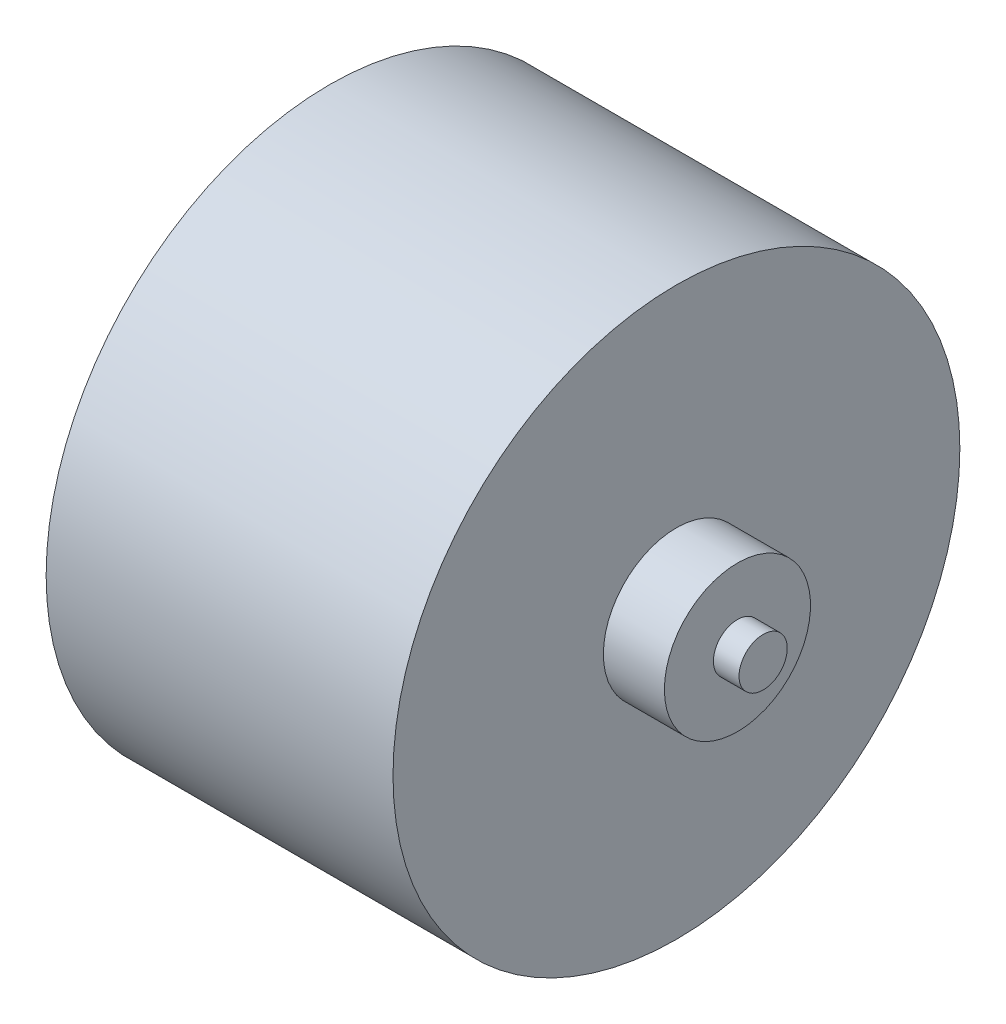
ISO-10303-21;
HEADER;
FILE_DESCRIPTION(('STEP AP214'),'2;1');
FILE_NAME('part.step','',(''),(''),'','','');
FILE_SCHEMA(('AUTOMOTIVE_DESIGN { 1 0 10303 214 1 1 1 1 }'));
ENDSEC;
DATA;
#1=APPLICATION_CONTEXT('core data for automotive mechanical design processes');
#2=APPLICATION_PROTOCOL_DEFINITION('international standard','automotive_design',2000,#1);
#3=PRODUCT_CONTEXT('',#1,'mechanical');
#4=PRODUCT('Part','Part','',(#3));
#5=PRODUCT_RELATED_PRODUCT_CATEGORY('part','',(#4));
#6=PRODUCT_DEFINITION_FORMATION('','',#4);
#7=PRODUCT_DEFINITION_CONTEXT('part definition',#1,'design');
#8=PRODUCT_DEFINITION('design','',#6,#7);
#9=PRODUCT_DEFINITION_SHAPE('','',#8);
#10=(LENGTH_UNIT() NAMED_UNIT(*) SI_UNIT(.MILLI.,.METRE.));
#11=(NAMED_UNIT(*) PLANE_ANGLE_UNIT() SI_UNIT($,.RADIAN.));
#12=(NAMED_UNIT(*) SI_UNIT($,.STERADIAN.) SOLID_ANGLE_UNIT());
#13=UNCERTAINTY_MEASURE_WITH_UNIT(LENGTH_MEASURE(1.E-05),#10,'distance_accuracy_value','');
#14=(GEOMETRIC_REPRESENTATION_CONTEXT(3) GLOBAL_UNCERTAINTY_ASSIGNED_CONTEXT((#13)) GLOBAL_UNIT_ASSIGNED_CONTEXT((#10,
#11,#12)) REPRESENTATION_CONTEXT('',''));
#15=CARTESIAN_POINT('',(0.,0.,0.));
#16=DIRECTION('',(0.,0.,1.));
#17=DIRECTION('',(1.,0.,0.));
#18=AXIS2_PLACEMENT_3D('',#15,#16,#17);
#19=CARTESIAN_POINT('',(-28.9528301886792,0.,0.));
#20=DIRECTION('',(-1.,0.,0.));
#21=DIRECTION('',(0.,0.,1.));
#22=AXIS2_PLACEMENT_3D('',#19,#20,#21);
#23=PLANE('',#22);
#24=CARTESIAN_POINT('',(-28.9528301886792,0.,0.));
#25=DIRECTION('',(-1.,0.,0.));
#26=DIRECTION('',(0.,0.,1.));
#27=AXIS2_PLACEMENT_3D('',#24,#25,#26);
#28=CIRCLE('',#27,1.5);
#29=CARTESIAN_POINT('',(-28.9528301886792,0.,1.5));
#30=VERTEX_POINT('',#29);
#31=EDGE_CURVE('E71',#30,#30,#28,.T.);
#32=ORIENTED_EDGE('',*,*,#31,.T.);
#33=EDGE_LOOP('',(#32));
#34=FACE_BOUND('',#33,.T.);
#35=ADVANCED_FACE('F37',(#34),#23,.T.);
#36=CARTESIAN_POINT('',(7.64716981132076,0.,0.));
#37=DIRECTION('',(1.,0.,0.));
#38=DIRECTION('',(0.,0.,-1.));
#39=AXIS2_PLACEMENT_3D('',#36,#37,#38);
#40=PLANE('',#39);
#41=CARTESIAN_POINT('',(7.64716981132076,0.,0.));
#42=DIRECTION('',(-1.,0.,0.));
#43=DIRECTION('',(0.,0.,1.));
#44=AXIS2_PLACEMENT_3D('',#41,#42,#43);
#45=CIRCLE('',#44,1.5);
#46=CARTESIAN_POINT('',(7.64716981132076,0.,1.5));
#47=VERTEX_POINT('',#46);
#48=EDGE_CURVE('E10',#47,#47,#45,.T.);
#49=ORIENTED_EDGE('',*,*,#48,.F.);
#50=EDGE_LOOP('',(#49));
#51=FACE_BOUND('',#50,.T.);
#52=ADVANCED_FACE('F135',(#51),#40,.T.);
#53=CARTESIAN_POINT('',(-28.9528301886792,0.,0.));
#54=DIRECTION('',(-1.,0.,0.));
#55=DIRECTION('',(0.,0.,1.));
#56=AXIS2_PLACEMENT_3D('',#53,#54,#55);
#57=CYLINDRICAL_SURFACE('',#56,1.5);
#58=ORIENTED_EDGE('',*,*,#48,.T.);
#59=EDGE_LOOP('',(#58));
#60=FACE_BOUND('',#59,.T.);
#61=CARTESIAN_POINT('',(6.04716981132076,0.,0.));
#62=DIRECTION('',(-1.,0.,0.));
#63=DIRECTION('',(0.,0.,1.));
#64=AXIS2_PLACEMENT_3D('',#61,#62,#63);
#65=CIRCLE('',#64,1.5);
#66=CARTESIAN_POINT('',(6.04716981132076,0.,1.5));
#67=VERTEX_POINT('',#66);
#68=EDGE_CURVE('E43',#67,#67,#65,.T.);
#69=ORIENTED_EDGE('',*,*,#68,.F.);
#70=EDGE_LOOP('',(#69));
#71=FACE_BOUND('',#70,.T.);
#72=ADVANCED_FACE('F140',(#60,#71),#57,.T.);
#73=CARTESIAN_POINT('',(6.04716981132076,0.,0.));
#74=DIRECTION('',(-1.,0.,0.));
#75=DIRECTION('',(0.,0.,1.));
#76=AXIS2_PLACEMENT_3D('',#73,#74,#75);
#77=PLANE('',#76);
#78=CARTESIAN_POINT('',(6.04716981132076,0.,0.));
#79=DIRECTION('',(-1.,0.,0.));
#80=DIRECTION('',(0.,0.,1.));
#81=AXIS2_PLACEMENT_3D('',#78,#79,#80);
#82=CIRCLE('',#81,4.55);
#83=CARTESIAN_POINT('',(6.04716981132076,0.,4.55));
#84=VERTEX_POINT('',#83);
#85=EDGE_CURVE('E47',#84,#84,#82,.T.);
#86=ORIENTED_EDGE('',*,*,#85,.F.);
#87=EDGE_LOOP('',(#86));
#88=FACE_BOUND('',#87,.T.);
#89=ORIENTED_EDGE('',*,*,#68,.T.);
#90=EDGE_LOOP('',(#89));
#91=FACE_BOUND('',#90,.T.);
#92=ADVANCED_FACE('F285',(#88,#91),#77,.F.);
#93=CARTESIAN_POINT('',(-28.9528301886792,0.,0.));
#94=DIRECTION('',(-1.,0.,0.));
#95=DIRECTION('',(0.,0.,1.));
#96=AXIS2_PLACEMENT_3D('',#93,#94,#95);
#97=CYLINDRICAL_SURFACE('',#96,4.55);
#98=ORIENTED_EDGE('',*,*,#85,.T.);
#99=EDGE_LOOP('',(#98));
#100=FACE_BOUND('',#99,.T.);
#101=CARTESIAN_POINT('',(2.24716981132076,0.,0.));
#102=DIRECTION('',(-1.,0.,0.));
#103=DIRECTION('',(0.,0.,1.));
#104=AXIS2_PLACEMENT_3D('',#101,#102,#103);
#105=CIRCLE('',#104,4.55);
#106=CARTESIAN_POINT('',(2.24716981132076,0.,4.55));
#107=VERTEX_POINT('',#106);
#108=EDGE_CURVE('E51',#107,#107,#105,.T.);
#109=ORIENTED_EDGE('',*,*,#108,.F.);
#110=EDGE_LOOP('',(#109));
#111=FACE_BOUND('',#110,.T.);
#112=ADVANCED_FACE('F131',(#100,#111),#97,.T.);
#113=CARTESIAN_POINT('',(2.24716981132076,0.,0.));
#114=DIRECTION('',(1.,0.,0.));
#115=DIRECTION('',(0.,0.,-1.));
#116=AXIS2_PLACEMENT_3D('',#113,#114,#115);
#117=PLANE('',#116);
#118=ORIENTED_EDGE('',*,*,#108,.T.);
#119=EDGE_LOOP('',(#118));
#120=FACE_BOUND('',#119,.T.);
#121=CARTESIAN_POINT('',(2.24716981132076,0.,0.));
#122=DIRECTION('',(-1.,0.,0.));
#123=DIRECTION('',(0.,0.,1.));
#124=AXIS2_PLACEMENT_3D('',#121,#122,#123);
#125=CIRCLE('',#124,17.65);
#126=CARTESIAN_POINT('',(2.24716981132076,0.,17.65));
#127=VERTEX_POINT('',#126);
#128=EDGE_CURVE('E56',#127,#127,#125,.T.);
#129=ORIENTED_EDGE('',*,*,#128,.F.);
#130=EDGE_LOOP('',(#129));
#131=FACE_BOUND('',#130,.T.);
#132=ADVANCED_FACE('F125',(#120,#131),#117,.T.);
#133=CARTESIAN_POINT('',(-28.9528301886792,0.,0.));
#134=DIRECTION('',(-1.,0.,0.));
#135=DIRECTION('',(0.,0.,1.));
#136=AXIS2_PLACEMENT_3D('',#133,#134,#135);
#137=CYLINDRICAL_SURFACE('',#136,17.65);
#138=ORIENTED_EDGE('',*,*,#128,.T.);
#139=EDGE_LOOP('',(#138));
#140=FACE_BOUND('',#139,.T.);
#141=CARTESIAN_POINT('',(-19.3528301886792,0.,0.));
#142=DIRECTION('',(-1.,0.,0.));
#143=DIRECTION('',(0.,0.,1.));
#144=AXIS2_PLACEMENT_3D('',#141,#142,#143);
#145=CIRCLE('',#144,17.65);
#146=CARTESIAN_POINT('',(-19.3528301886792,0.,17.65));
#147=VERTEX_POINT('',#146);
#148=EDGE_CURVE('E59',#147,#147,#145,.T.);
#149=ORIENTED_EDGE('',*,*,#148,.F.);
#150=EDGE_LOOP('',(#149));
#151=FACE_BOUND('',#150,.T.);
#152=ADVANCED_FACE('F112',(#140,#151),#137,.T.);
#153=CARTESIAN_POINT('',(-19.3528301886792,0.,0.));
#154=DIRECTION('',(1.,0.,0.));
#155=DIRECTION('',(0.,0.,-1.));
#156=AXIS2_PLACEMENT_3D('',#153,#154,#155);
#157=PLANE('',#156);
#158=CARTESIAN_POINT('',(-19.3528301886792,12.5,0.));
#159=DIRECTION('',(-1.,0.,0.));
#160=DIRECTION('',(0.,0.,1.));
#161=AXIS2_PLACEMENT_3D('',#158,#159,#160);
#162=CIRCLE('',#161,2.);
#163=CARTESIAN_POINT('',(-19.3528301886792,12.5,2.));
#164=VERTEX_POINT('',#163);
#165=EDGE_CURVE('E93',#164,#164,#162,.T.);
#166=ORIENTED_EDGE('',*,*,#165,.F.);
#167=EDGE_LOOP('',(#166));
#168=FACE_BOUND('',#167,.T.);
#169=CARTESIAN_POINT('',(-19.3528301886792,-12.5,0.));
#170=DIRECTION('',(-1.,0.,0.));
#171=DIRECTION('',(0.,0.,-1.));
#172=AXIS2_PLACEMENT_3D('',#169,#170,#171);
#173=CIRCLE('',#172,2.);
#174=CARTESIAN_POINT('',(-19.3528301886792,-12.5,-2.));
#175=VERTEX_POINT('',#174);
#176=EDGE_CURVE('E87',#175,#175,#173,.T.);
#177=ORIENTED_EDGE('',*,*,#176,.F.);
#178=EDGE_LOOP('',(#177));
#179=FACE_BOUND('',#178,.T.);
#180=CARTESIAN_POINT('',(-19.3528301886792,0.,-12.5));
#181=DIRECTION('',(-1.,0.,0.));
#182=DIRECTION('',(0.,0.,1.));
#183=AXIS2_PLACEMENT_3D('',#180,#181,#182);
#184=CIRCLE('',#183,2.);
#185=CARTESIAN_POINT('',(-19.3528301886792,0.,-10.5));
#186=VERTEX_POINT('',#185);
#187=EDGE_CURVE('E81',#186,#186,#184,.T.);
#188=ORIENTED_EDGE('',*,*,#187,.F.);
#189=EDGE_LOOP('',(#188));
#190=FACE_BOUND('',#189,.T.);
#191=CARTESIAN_POINT('',(-19.3528301886792,0.,12.5));
#192=DIRECTION('',(-1.,0.,0.));
#193=DIRECTION('',(0.,0.,-1.));
#194=AXIS2_PLACEMENT_3D('',#191,#192,#193);
#195=CIRCLE('',#194,2.);
#196=CARTESIAN_POINT('',(-19.3528301886792,0.,10.5));
#197=VERTEX_POINT('',#196);
#198=EDGE_CURVE('E75',#197,#197,#195,.T.);
#199=ORIENTED_EDGE('',*,*,#198,.F.);
#200=EDGE_LOOP('',(#199));
#201=FACE_BOUND('',#200,.T.);
#202=CARTESIAN_POINT('',(-19.3528301886792,0.,0.));
#203=DIRECTION('',(-1.,0.,0.));
#204=DIRECTION('',(0.,0.,1.));
#205=AXIS2_PLACEMENT_3D('',#202,#203,#204);
#206=CIRCLE('',#205,4.55);
#207=CARTESIAN_POINT('',(-19.3528301886792,0.,4.55));
#208=VERTEX_POINT('',#207);
#209=EDGE_CURVE('E62',#208,#208,#206,.T.);
#210=ORIENTED_EDGE('',*,*,#209,.F.);
#211=EDGE_LOOP('',(#210));
#212=FACE_BOUND('',#211,.T.);
#213=ORIENTED_EDGE('',*,*,#148,.T.);
#214=EDGE_LOOP('',(#213));
#215=FACE_BOUND('',#214,.T.);
#216=ADVANCED_FACE('F108',(#168,#179,#190,#201,#212,#215),#157,.F.);
#217=CARTESIAN_POINT('',(-28.9528301886792,0.,0.));
#218=DIRECTION('',(-1.,0.,0.));
#219=DIRECTION('',(0.,0.,1.));
#220=AXIS2_PLACEMENT_3D('',#217,#218,#219);
#221=CYLINDRICAL_SURFACE('',#220,4.55);
#222=ORIENTED_EDGE('',*,*,#209,.T.);
#223=EDGE_LOOP('',(#222));
#224=FACE_BOUND('',#223,.T.);
#225=CARTESIAN_POINT('',(-22.3528301886792,0.,0.));
#226=DIRECTION('',(-1.,0.,0.));
#227=DIRECTION('',(0.,0.,1.));
#228=AXIS2_PLACEMENT_3D('',#225,#226,#227);
#229=CIRCLE('',#228,4.55);
#230=CARTESIAN_POINT('',(-22.3528301886792,0.,4.55));
#231=VERTEX_POINT('',#230);
#232=EDGE_CURVE('E65',#231,#231,#229,.T.);
#233=ORIENTED_EDGE('',*,*,#232,.F.);
#234=EDGE_LOOP('',(#233));
#235=FACE_BOUND('',#234,.T.);
#236=ADVANCED_FACE('F111',(#224,#235),#221,.T.);
#237=CARTESIAN_POINT('',(-22.3528301886792,0.,0.));
#238=DIRECTION('',(1.,0.,0.));
#239=DIRECTION('',(0.,0.,-1.));
#240=AXIS2_PLACEMENT_3D('',#237,#238,#239);
#241=PLANE('',#240);
#242=CARTESIAN_POINT('',(-22.3528301886792,0.,0.));
#243=DIRECTION('',(-1.,0.,0.));
#244=DIRECTION('',(0.,0.,1.));
#245=AXIS2_PLACEMENT_3D('',#242,#243,#244);
#246=CIRCLE('',#245,1.5);
#247=CARTESIAN_POINT('',(-22.3528301886792,0.,1.5));
#248=VERTEX_POINT('',#247);
#249=EDGE_CURVE('E68',#248,#248,#246,.T.);
#250=ORIENTED_EDGE('',*,*,#249,.F.);
#251=EDGE_LOOP('',(#250));
#252=FACE_BOUND('',#251,.T.);
#253=ORIENTED_EDGE('',*,*,#232,.T.);
#254=EDGE_LOOP('',(#253));
#255=FACE_BOUND('',#254,.T.);
#256=ADVANCED_FACE('F147',(#252,#255),#241,.F.);
#257=CARTESIAN_POINT('',(-28.9528301886792,0.,0.));
#258=DIRECTION('',(-1.,0.,0.));
#259=DIRECTION('',(0.,0.,1.));
#260=AXIS2_PLACEMENT_3D('',#257,#258,#259);
#261=CYLINDRICAL_SURFACE('',#260,1.5);
#262=ORIENTED_EDGE('',*,*,#249,.T.);
#263=EDGE_LOOP('',(#262));
#264=FACE_BOUND('',#263,.T.);
#265=ORIENTED_EDGE('',*,*,#31,.F.);
#266=EDGE_LOOP('',(#265));
#267=FACE_BOUND('',#266,.T.);
#268=ADVANCED_FACE('F144',(#264,#267),#261,.T.);
#269=CARTESIAN_POINT('',(-14.3528301886792,0.,12.5));
#270=DIRECTION('',(-1.,0.,0.));
#271=DIRECTION('',(0.,0.,1.));
#272=AXIS2_PLACEMENT_3D('',#269,#270,#271);
#273=CYLINDRICAL_SURFACE('',#272,2.);
#274=CARTESIAN_POINT('',(-14.3528301886792,0.,12.5));
#275=DIRECTION('',(-1.,0.,0.));
#276=DIRECTION('',(0.,0.,-1.));
#277=AXIS2_PLACEMENT_3D('',#274,#275,#276);
#278=CIRCLE('',#277,2.);
#279=CARTESIAN_POINT('',(-14.3528301886792,0.,10.5));
#280=VERTEX_POINT('',#279);
#281=EDGE_CURVE('E78',#280,#280,#278,.T.);
#282=ORIENTED_EDGE('',*,*,#281,.F.);
#283=EDGE_LOOP('',(#282));
#284=FACE_BOUND('',#283,.T.);
#285=ORIENTED_EDGE('',*,*,#198,.T.);
#286=EDGE_LOOP('',(#285));
#287=FACE_BOUND('',#286,.T.);
#288=ADVANCED_FACE('F146',(#284,#287),#273,.F.);
#289=CARTESIAN_POINT('',(-14.3528301886792,0.,12.5));
#290=DIRECTION('',(1.,0.,0.));
#291=DIRECTION('',(0.,0.,-1.));
#292=AXIS2_PLACEMENT_3D('',#289,#290,#291);
#293=PLANE('',#292);
#294=ORIENTED_EDGE('',*,*,#281,.T.);
#295=EDGE_LOOP('',(#294));
#296=FACE_BOUND('',#295,.T.);
#297=ADVANCED_FACE('F154',(#296),#293,.F.);
#298=CARTESIAN_POINT('',(-14.3528301886792,0.,-12.5));
#299=DIRECTION('',(-1.,0.,0.));
#300=DIRECTION('',(0.,0.,1.));
#301=AXIS2_PLACEMENT_3D('',#298,#299,#300);
#302=CYLINDRICAL_SURFACE('',#301,2.);
#303=CARTESIAN_POINT('',(-14.3528301886792,0.,-12.5));
#304=DIRECTION('',(-1.,0.,0.));
#305=DIRECTION('',(0.,0.,1.));
#306=AXIS2_PLACEMENT_3D('',#303,#304,#305);
#307=CIRCLE('',#306,2.);
#308=CARTESIAN_POINT('',(-14.3528301886792,0.,-10.5));
#309=VERTEX_POINT('',#308);
#310=EDGE_CURVE('E84',#309,#309,#307,.T.);
#311=ORIENTED_EDGE('',*,*,#310,.F.);
#312=EDGE_LOOP('',(#311));
#313=FACE_BOUND('',#312,.T.);
#314=ORIENTED_EDGE('',*,*,#187,.T.);
#315=EDGE_LOOP('',(#314));
#316=FACE_BOUND('',#315,.T.);
#317=ADVANCED_FACE('F199',(#313,#316),#302,.F.);
#318=CARTESIAN_POINT('',(-14.3528301886792,0.,-12.5));
#319=DIRECTION('',(-1.,0.,0.));
#320=DIRECTION('',(0.,0.,1.));
#321=AXIS2_PLACEMENT_3D('',#318,#319,#320);
#322=PLANE('',#321);
#323=ORIENTED_EDGE('',*,*,#310,.T.);
#324=EDGE_LOOP('',(#323));
#325=FACE_BOUND('',#324,.T.);
#326=ADVANCED_FACE('F208',(#325),#322,.T.);
#327=CARTESIAN_POINT('',(-14.3528301886792,-12.5,0.));
#328=DIRECTION('',(-1.,0.,0.));
#329=DIRECTION('',(0.,0.,1.));
#330=AXIS2_PLACEMENT_3D('',#327,#328,#329);
#331=CYLINDRICAL_SURFACE('',#330,2.);
#332=CARTESIAN_POINT('',(-14.3528301886792,-12.5,0.));
#333=DIRECTION('',(-1.,0.,0.));
#334=DIRECTION('',(0.,0.,-1.));
#335=AXIS2_PLACEMENT_3D('',#332,#333,#334);
#336=CIRCLE('',#335,2.);
#337=CARTESIAN_POINT('',(-14.3528301886792,-12.5,-2.));
#338=VERTEX_POINT('',#337);
#339=EDGE_CURVE('E90',#338,#338,#336,.T.);
#340=ORIENTED_EDGE('',*,*,#339,.F.);
#341=EDGE_LOOP('',(#340));
#342=FACE_BOUND('',#341,.T.);
#343=ORIENTED_EDGE('',*,*,#176,.T.);
#344=EDGE_LOOP('',(#343));
#345=FACE_BOUND('',#344,.T.);
#346=ADVANCED_FACE('F218',(#342,#345),#331,.F.);
#347=CARTESIAN_POINT('',(-14.3528301886792,-12.5,0.));
#348=DIRECTION('',(1.,0.,0.));
#349=DIRECTION('',(0.,0.,-1.));
#350=AXIS2_PLACEMENT_3D('',#347,#348,#349);
#351=PLANE('',#350);
#352=ORIENTED_EDGE('',*,*,#339,.T.);
#353=EDGE_LOOP('',(#352));
#354=FACE_BOUND('',#353,.T.);
#355=ADVANCED_FACE('F104',(#354),#351,.F.);
#356=CARTESIAN_POINT('',(-14.3528301886792,12.5,0.));
#357=DIRECTION('',(-1.,0.,0.));
#358=DIRECTION('',(0.,0.,1.));
#359=AXIS2_PLACEMENT_3D('',#356,#357,#358);
#360=CYLINDRICAL_SURFACE('',#359,2.);
#361=CARTESIAN_POINT('',(-14.3528301886792,12.5,0.));
#362=DIRECTION('',(-1.,0.,0.));
#363=DIRECTION('',(0.,0.,1.));
#364=AXIS2_PLACEMENT_3D('',#361,#362,#363);
#365=CIRCLE('',#364,2.);
#366=CARTESIAN_POINT('',(-14.3528301886792,12.5,2.));
#367=VERTEX_POINT('',#366);
#368=EDGE_CURVE('E74',#367,#367,#365,.T.);
#369=ORIENTED_EDGE('',*,*,#368,.F.);
#370=EDGE_LOOP('',(#369));
#371=FACE_BOUND('',#370,.T.);
#372=ORIENTED_EDGE('',*,*,#165,.T.);
#373=EDGE_LOOP('',(#372));
#374=FACE_BOUND('',#373,.T.);
#375=ADVANCED_FACE('F101',(#371,#374),#360,.F.);
#376=CARTESIAN_POINT('',(-14.3528301886792,12.5,0.));
#377=DIRECTION('',(-1.,0.,0.));
#378=DIRECTION('',(0.,0.,1.));
#379=AXIS2_PLACEMENT_3D('',#376,#377,#378);
#380=PLANE('',#379);
#381=ORIENTED_EDGE('',*,*,#368,.T.);
#382=EDGE_LOOP('',(#381));
#383=FACE_BOUND('',#382,.T.);
#384=ADVANCED_FACE('F99',(#383),#380,.T.);
#385=CLOSED_SHELL('',(#35,#52,#72,#92,#112,#132,#152,#216,#236,#256,#268,#288,#297,#317,#326,
#346,#355,#375,#384));
#386=MANIFOLD_SOLID_BREP('B2',#385);
#387=ADVANCED_BREP_SHAPE_REPRESENTATION('',(#18,#386),#14);
#388=SHAPE_DEFINITION_REPRESENTATION(#9,#387);
ENDSEC;
END-ISO-10303-21;
